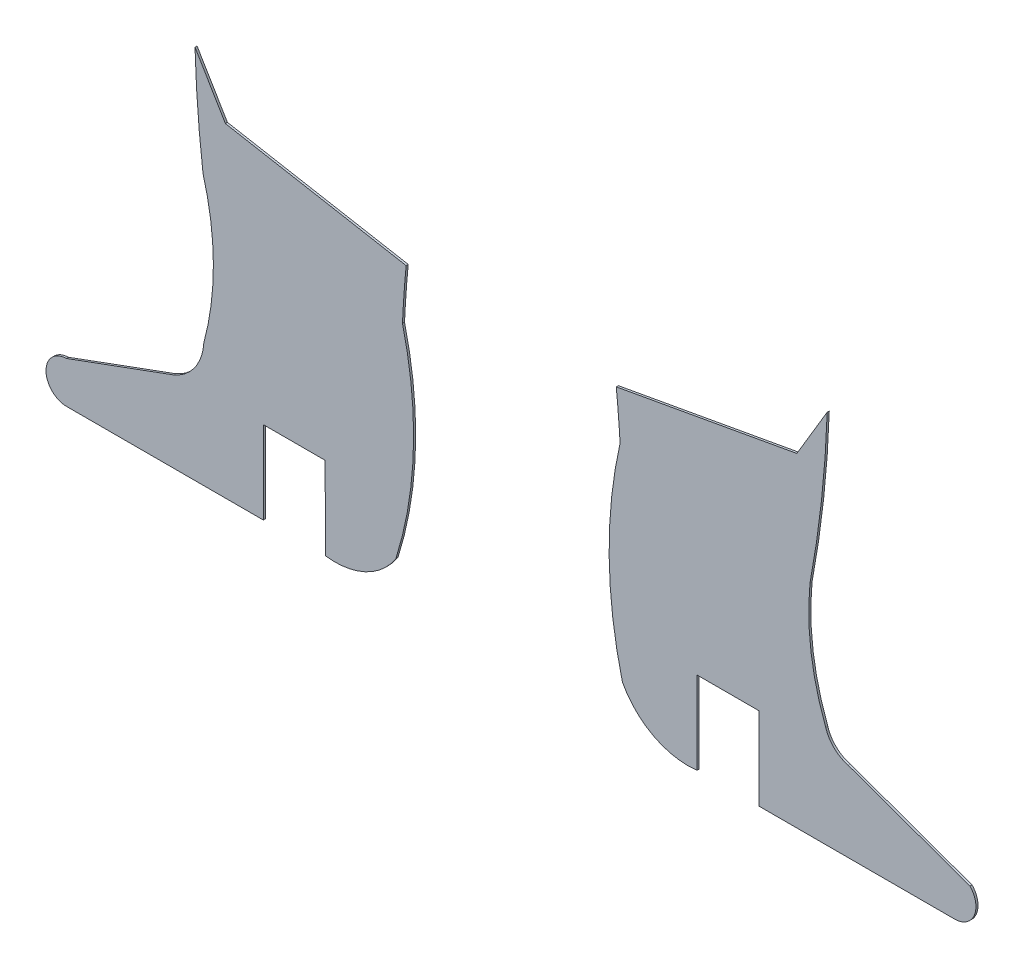
ISO-10303-21;
HEADER;
FILE_DESCRIPTION(('STEP AP214'),'2;1');
FILE_NAME('part.step','',(''),(''),'','','');
FILE_SCHEMA(('AUTOMOTIVE_DESIGN { 1 0 10303 214 1 1 1 1 }'));
ENDSEC;
DATA;
#1=APPLICATION_CONTEXT('core data for automotive mechanical design processes');
#2=APPLICATION_PROTOCOL_DEFINITION('international standard','automotive_design',2000,#1);
#3=PRODUCT_CONTEXT('',#1,'mechanical');
#4=PRODUCT('Part','Part','',(#3));
#5=PRODUCT_RELATED_PRODUCT_CATEGORY('part','',(#4));
#6=PRODUCT_DEFINITION_FORMATION('','',#4);
#7=PRODUCT_DEFINITION_CONTEXT('part definition',#1,'design');
#8=PRODUCT_DEFINITION('design','',#6,#7);
#9=PRODUCT_DEFINITION_SHAPE('','',#8);
#10=(LENGTH_UNIT() NAMED_UNIT(*) SI_UNIT(.MILLI.,.METRE.));
#11=(NAMED_UNIT(*) PLANE_ANGLE_UNIT() SI_UNIT($,.RADIAN.));
#12=(NAMED_UNIT(*) SI_UNIT($,.STERADIAN.) SOLID_ANGLE_UNIT());
#13=UNCERTAINTY_MEASURE_WITH_UNIT(LENGTH_MEASURE(1.E-05),#10,'distance_accuracy_value','');
#14=(GEOMETRIC_REPRESENTATION_CONTEXT(3) GLOBAL_UNCERTAINTY_ASSIGNED_CONTEXT((#13)) GLOBAL_UNIT_ASSIGNED_CONTEXT((#10,
#11,#12)) REPRESENTATION_CONTEXT('',''));
#15=CARTESIAN_POINT('',(0.,0.,0.));
#16=DIRECTION('',(0.,0.,1.));
#17=DIRECTION('',(1.,0.,0.));
#18=AXIS2_PLACEMENT_3D('',#15,#16,#17);
#19=CARTESIAN_POINT('',(26.9668124173611,-36.5903102609437,0.1));
#20=DIRECTION('',(0.,0.,-1.));
#21=DIRECTION('',(-1.,0.,0.));
#22=AXIS2_PLACEMENT_3D('',#19,#20,#21);
#23=CYLINDRICAL_SURFACE('',#22,3.50774536929648);
#24=CARTESIAN_POINT('',(26.9668124173611,-36.5903102609437,0.));
#25=DIRECTION('',(0.,0.,1.));
#26=DIRECTION('',(1.,0.,0.));
#27=AXIS2_PLACEMENT_3D('',#24,#25,#26);
#28=CIRCLE('',#27,3.50774536929648);
#29=CARTESIAN_POINT('',(26.5060514652921,-40.067662259357,0.));
#30=VERTEX_POINT('',#29);
#31=CARTESIAN_POINT('',(29.9209690938773,-38.4816684783142,0.));
#32=VERTEX_POINT('',#31);
#33=EDGE_CURVE('E175',#30,#32,#28,.T.);
#34=ORIENTED_EDGE('',*,*,#33,.T.);
#35=DIRECTION('',(0.,0.,-1.));
#36=VECTOR('',#35,1.);
#37=CARTESIAN_POINT('',(29.9209690938773,-38.4816684783142,0.1));
#38=LINE('',#37,#36);
#39=CARTESIAN_POINT('',(29.9209690938773,-38.4816684783142,0.1));
#40=VERTEX_POINT('',#39);
#41=EDGE_CURVE('E12',#40,#32,#38,.T.);
#42=ORIENTED_EDGE('',*,*,#41,.F.);
#43=CARTESIAN_POINT('',(26.9668124173611,-36.5903102609437,0.1));
#44=DIRECTION('',(0.,0.,1.));
#45=DIRECTION('',(1.,0.,0.));
#46=AXIS2_PLACEMENT_3D('',#43,#44,#45);
#47=CIRCLE('',#46,3.50774536929648);
#48=CARTESIAN_POINT('',(26.5060514652921,-40.067662259357,0.1));
#49=VERTEX_POINT('',#48);
#50=EDGE_CURVE('E201',#49,#40,#47,.T.);
#51=ORIENTED_EDGE('',*,*,#50,.F.);
#52=DIRECTION('',(0.,0.,-1.));
#53=VECTOR('',#52,1.);
#54=CARTESIAN_POINT('',(26.5060514652921,-40.067662259357,0.1));
#55=LINE('',#54,#53);
#56=EDGE_CURVE('E171',#49,#30,#55,.T.);
#57=ORIENTED_EDGE('',*,*,#56,.T.);
#58=EDGE_LOOP('',(#34,#42,#51,#57));
#59=FACE_BOUND('',#58,.T.);
#60=ADVANCED_FACE('F43',(#59),#23,.T.);
#61=CARTESIAN_POINT('',(12.2605166746826,-32.9008854136209,0.1));
#62=DIRECTION('',(0.,0.,-1.));
#63=DIRECTION('',(-1.,0.,0.));
#64=AXIS2_PLACEMENT_3D('',#61,#62,#63);
#65=CYLINDRICAL_SURFACE('',#64,18.5212504779188);
#66=CARTESIAN_POINT('',(12.2605166746826,-32.9008854136209,0.));
#67=DIRECTION('',(0.,0.,1.));
#68=DIRECTION('',(1.,0.,0.));
#69=AXIS2_PLACEMENT_3D('',#66,#67,#68);
#70=CIRCLE('',#69,18.5212504779188);
#71=CARTESIAN_POINT('',(30.2407803949786,-28.4571442179148,0.));
#72=VERTEX_POINT('',#71);
#73=EDGE_CURVE('E178',#32,#72,#70,.T.);
#74=ORIENTED_EDGE('',*,*,#73,.T.);
#75=DIRECTION('',(0.,0.,-1.));
#76=VECTOR('',#75,1.);
#77=CARTESIAN_POINT('',(30.2407803949786,-28.4571442179148,0.1));
#78=LINE('',#77,#76);
#79=CARTESIAN_POINT('',(30.2407803949786,-28.4571442179148,0.1));
#80=VERTEX_POINT('',#79);
#81=EDGE_CURVE('E51',#80,#72,#78,.T.);
#82=ORIENTED_EDGE('',*,*,#81,.F.);
#83=CARTESIAN_POINT('',(12.2605166746826,-32.9008854136209,0.1));
#84=DIRECTION('',(0.,0.,1.));
#85=DIRECTION('',(1.,0.,0.));
#86=AXIS2_PLACEMENT_3D('',#83,#84,#85);
#87=CIRCLE('',#86,18.5212504779188);
#88=EDGE_CURVE('E120',#40,#80,#87,.T.);
#89=ORIENTED_EDGE('',*,*,#88,.F.);
#90=ORIENTED_EDGE('',*,*,#41,.T.);
#91=EDGE_LOOP('',(#74,#82,#89,#90));
#92=FACE_BOUND('',#91,.T.);
#93=ADVANCED_FACE('F289',(#92),#65,.T.);
#94=CARTESIAN_POINT('',(83.6487375370313,-30.9690868706953,0.1));
#95=DIRECTION('',(0.,0.,-1.));
#96=DIRECTION('',(-1.,0.,0.));
#97=AXIS2_PLACEMENT_3D('',#94,#95,#96);
#98=CYLINDRICAL_SURFACE('',#97,53.4669967548037);
#99=CARTESIAN_POINT('',(83.6487375370313,-30.9690868706953,0.));
#100=DIRECTION('',(0.,0.,-1.));
#101=DIRECTION('',(1.,0.,0.));
#102=AXIS2_PLACEMENT_3D('',#99,#100,#101);
#103=CIRCLE('',#102,53.4669967548037);
#104=CARTESIAN_POINT('',(30.418644104399,-25.9414736067863,0.));
#105=VERTEX_POINT('',#104);
#106=EDGE_CURVE('E180',#72,#105,#103,.T.);
#107=ORIENTED_EDGE('',*,*,#106,.T.);
#108=DIRECTION('',(0.,0.,-1.));
#109=VECTOR('',#108,1.);
#110=CARTESIAN_POINT('',(30.418644104399,-25.9414736067863,0.1));
#111=LINE('',#110,#109);
#112=CARTESIAN_POINT('',(30.418644104399,-25.9414736067863,0.1));
#113=VERTEX_POINT('',#112);
#114=EDGE_CURVE('E226',#113,#105,#111,.T.);
#115=ORIENTED_EDGE('',*,*,#114,.F.);
#116=CARTESIAN_POINT('',(83.6487375370313,-30.9690868706953,0.1));
#117=DIRECTION('',(0.,0.,-1.));
#118=DIRECTION('',(1.,0.,0.));
#119=AXIS2_PLACEMENT_3D('',#116,#117,#118);
#120=CIRCLE('',#119,53.4669967548037);
#121=EDGE_CURVE('E234',#80,#113,#120,.T.);
#122=ORIENTED_EDGE('',*,*,#121,.F.);
#123=ORIENTED_EDGE('',*,*,#81,.T.);
#124=EDGE_LOOP('',(#107,#115,#122,#123));
#125=FACE_BOUND('',#124,.T.);
#126=ADVANCED_FACE('F232',(#125),#98,.F.);
#127=CARTESIAN_POINT('',(21.6663416401417,-24.3621518908138,0.1));
#128=DIRECTION('',(-0.177578526798536,-0.984106633866504,0.));
#129=DIRECTION('',(0.984106633866504,-0.177578526798536,0.));
#130=AXIS2_PLACEMENT_3D('',#127,#128,#129);
#131=PLANE('',#130);
#132=DIRECTION('',(-0.984106633866504,0.177578526798536,0.));
#133=VECTOR('',#132,1.);
#134=CARTESIAN_POINT('',(21.6663416401417,-24.3621518908138,0.));
#135=LINE('',#134,#133);
#136=CARTESIAN_POINT('',(21.6663416401417,-24.3621518908138,0.));
#137=VERTEX_POINT('',#136);
#138=EDGE_CURVE('E182',#105,#137,#135,.T.);
#139=ORIENTED_EDGE('',*,*,#138,.T.);
#140=DIRECTION('',(0.,0.,-1.));
#141=VECTOR('',#140,1.);
#142=CARTESIAN_POINT('',(21.6663416401417,-24.3621518908138,0.1));
#143=LINE('',#142,#141);
#144=CARTESIAN_POINT('',(21.6663416401417,-24.3621518908138,0.1));
#145=VERTEX_POINT('',#144);
#146=EDGE_CURVE('E223',#145,#137,#143,.T.);
#147=ORIENTED_EDGE('',*,*,#146,.F.);
#148=DIRECTION('',(-0.984106633866504,0.177578526798536,0.));
#149=VECTOR('',#148,1.);
#150=CARTESIAN_POINT('',(21.6663416401417,-24.3621518908138,0.1));
#151=LINE('',#150,#149);
#152=EDGE_CURVE('E252',#113,#145,#151,.T.);
#153=ORIENTED_EDGE('',*,*,#152,.F.);
#154=ORIENTED_EDGE('',*,*,#114,.T.);
#155=EDGE_LOOP('',(#139,#147,#153,#154));
#156=FACE_BOUND('',#155,.T.);
#157=ADVANCED_FACE('F243',(#156),#131,.F.);
#158=CARTESIAN_POINT('',(20.1968502259479,-21.8973035343896,0.1));
#159=DIRECTION('',(-0.858937381336888,-0.512080633242588,0.));
#160=DIRECTION('',(0.512080633242588,-0.858937381336888,0.));
#161=AXIS2_PLACEMENT_3D('',#158,#159,#160);
#162=PLANE('',#161);
#163=DIRECTION('',(-0.512080633242588,0.858937381336888,0.));
#164=VECTOR('',#163,1.);
#165=CARTESIAN_POINT('',(20.1968502259479,-21.8973035343896,0.));
#166=LINE('',#165,#164);
#167=CARTESIAN_POINT('',(20.1968502259479,-21.8973035343896,0.));
#168=VERTEX_POINT('',#167);
#169=EDGE_CURVE('E184',#137,#168,#166,.T.);
#170=ORIENTED_EDGE('',*,*,#169,.T.);
#171=DIRECTION('',(0.,0.,-1.));
#172=VECTOR('',#171,1.);
#173=CARTESIAN_POINT('',(20.1968502259479,-21.8973035343896,0.1));
#174=LINE('',#173,#172);
#175=CARTESIAN_POINT('',(20.1968502259479,-21.8973035343896,0.1));
#176=VERTEX_POINT('',#175);
#177=EDGE_CURVE('E220',#176,#168,#174,.T.);
#178=ORIENTED_EDGE('',*,*,#177,.F.);
#179=DIRECTION('',(-0.512080633242588,0.858937381336888,0.));
#180=VECTOR('',#179,1.);
#181=CARTESIAN_POINT('',(20.1968502259479,-21.8973035343896,0.1));
#182=LINE('',#181,#180);
#183=EDGE_CURVE('E249',#145,#176,#182,.T.);
#184=ORIENTED_EDGE('',*,*,#183,.F.);
#185=ORIENTED_EDGE('',*,*,#146,.T.);
#186=EDGE_LOOP('',(#170,#178,#184,#185));
#187=FACE_BOUND('',#186,.T.);
#188=ADVANCED_FACE('F247',(#187),#162,.F.);
#189=CARTESIAN_POINT('',(74.3235203997203,-20.34952385995,0.1));
#190=DIRECTION('',(0.,0.,-1.));
#191=DIRECTION('',(-1.,0.,0.));
#192=AXIS2_PLACEMENT_3D('',#189,#190,#191);
#193=CYLINDRICAL_SURFACE('',#192,54.148795425392);
#194=CARTESIAN_POINT('',(74.3235203997203,-20.34952385995,0.));
#195=DIRECTION('',(0.,0.,1.));
#196=DIRECTION('',(1.,0.,0.));
#197=AXIS2_PLACEMENT_3D('',#194,#195,#196);
#198=CIRCLE('',#197,54.148795425392);
#199=CARTESIAN_POINT('',(20.5846174061034,-26.9995126617135,0.));
#200=VERTEX_POINT('',#199);
#201=EDGE_CURVE('E186',#168,#200,#198,.T.);
#202=ORIENTED_EDGE('',*,*,#201,.T.);
#203=DIRECTION('',(0.,0.,-1.));
#204=VECTOR('',#203,1.);
#205=CARTESIAN_POINT('',(20.5846174061034,-26.9995126617135,0.1));
#206=LINE('',#205,#204);
#207=CARTESIAN_POINT('',(20.5846174061034,-26.9995126617135,0.1));
#208=VERTEX_POINT('',#207);
#209=EDGE_CURVE('E217',#208,#200,#206,.T.);
#210=ORIENTED_EDGE('',*,*,#209,.F.);
#211=CARTESIAN_POINT('',(74.3235203997203,-20.34952385995,0.1));
#212=DIRECTION('',(0.,0.,1.));
#213=DIRECTION('',(1.,0.,0.));
#214=AXIS2_PLACEMENT_3D('',#211,#212,#213);
#215=CIRCLE('',#214,54.148795425392);
#216=EDGE_CURVE('E251',#176,#208,#215,.T.);
#217=ORIENTED_EDGE('',*,*,#216,.F.);
#218=ORIENTED_EDGE('',*,*,#177,.T.);
#219=EDGE_LOOP('',(#202,#210,#217,#218));
#220=FACE_BOUND('',#219,.T.);
#221=ADVANCED_FACE('F302',(#220),#193,.T.);
#222=CARTESIAN_POINT('',(7.84179174265444,-30.6110247408629,0.1));
#223=DIRECTION('',(0.,0.,-1.));
#224=DIRECTION('',(-1.,0.,0.));
#225=AXIS2_PLACEMENT_3D('',#222,#223,#224);
#226=CYLINDRICAL_SURFACE('',#225,13.2447206609613);
#227=CARTESIAN_POINT('',(7.84179174265444,-30.6110247408629,0.));
#228=DIRECTION('',(0.,0.,-1.));
#229=DIRECTION('',(1.,0.,0.));
#230=AXIS2_PLACEMENT_3D('',#227,#228,#229);
#231=CIRCLE('',#230,13.2447206609613);
#232=CARTESIAN_POINT('',(20.6215773255446,-34.0894878845871,0.));
#233=VERTEX_POINT('',#232);
#234=EDGE_CURVE('E188',#200,#233,#231,.T.);
#235=ORIENTED_EDGE('',*,*,#234,.T.);
#236=DIRECTION('',(0.,0.,-1.));
#237=VECTOR('',#236,1.);
#238=CARTESIAN_POINT('',(20.6215773255446,-34.0894878845871,0.1));
#239=LINE('',#238,#237);
#240=CARTESIAN_POINT('',(20.6215773255446,-34.0894878845871,0.1));
#241=VERTEX_POINT('',#240);
#242=EDGE_CURVE('E214',#241,#233,#239,.T.);
#243=ORIENTED_EDGE('',*,*,#242,.F.);
#244=CARTESIAN_POINT('',(7.84179174265444,-30.6110247408629,0.1));
#245=DIRECTION('',(0.,0.,-1.));
#246=DIRECTION('',(1.,0.,0.));
#247=AXIS2_PLACEMENT_3D('',#244,#245,#246);
#248=CIRCLE('',#247,13.2447206609613);
#249=EDGE_CURVE('E254',#208,#241,#248,.T.);
#250=ORIENTED_EDGE('',*,*,#249,.F.);
#251=ORIENTED_EDGE('',*,*,#209,.T.);
#252=EDGE_LOOP('',(#235,#243,#250,#251));
#253=FACE_BOUND('',#252,.T.);
#254=ADVANCED_FACE('F305',(#253),#226,.F.);
#255=CARTESIAN_POINT('',(18.2302408129095,-33.9493431378482,0.1));
#256=DIRECTION('',(0.,0.,-1.));
#257=DIRECTION('',(-1.,0.,0.));
#258=AXIS2_PLACEMENT_3D('',#255,#256,#257);
#259=CYLINDRICAL_SURFACE('',#258,2.39543959779839);
#260=CARTESIAN_POINT('',(18.2302408129095,-33.9493431378482,0.));
#261=DIRECTION('',(0.,0.,-1.));
#262=DIRECTION('',(1.,0.,0.));
#263=AXIS2_PLACEMENT_3D('',#260,#261,#262);
#264=CIRCLE('',#263,2.39543959779839);
#265=CARTESIAN_POINT('',(19.1662659452414,-36.1543347066175,0.));
#266=VERTEX_POINT('',#265);
#267=EDGE_CURVE('E190',#233,#266,#264,.T.);
#268=ORIENTED_EDGE('',*,*,#267,.T.);
#269=DIRECTION('',(0.,0.,-1.));
#270=VECTOR('',#269,1.);
#271=CARTESIAN_POINT('',(19.1662659452414,-36.1543347066175,0.1));
#272=LINE('',#271,#270);
#273=CARTESIAN_POINT('',(19.1662659452414,-36.1543347066175,0.1));
#274=VERTEX_POINT('',#273);
#275=EDGE_CURVE('E211',#274,#266,#272,.T.);
#276=ORIENTED_EDGE('',*,*,#275,.F.);
#277=CARTESIAN_POINT('',(18.2302408129095,-33.9493431378482,0.1));
#278=DIRECTION('',(0.,0.,-1.));
#279=DIRECTION('',(1.,0.,0.));
#280=AXIS2_PLACEMENT_3D('',#277,#278,#279);
#281=CIRCLE('',#280,2.39543959779839);
#282=EDGE_CURVE('E260',#241,#274,#281,.T.);
#283=ORIENTED_EDGE('',*,*,#282,.F.);
#284=ORIENTED_EDGE('',*,*,#242,.T.);
#285=EDGE_LOOP('',(#268,#276,#283,#284));
#286=FACE_BOUND('',#285,.T.);
#287=ADVANCED_FACE('F309',(#286),#259,.F.);
#288=CARTESIAN_POINT('',(19.1662659452414,-36.1543347066175,0.1));
#289=DIRECTION('',(0.344465571501462,-0.938798950814375,0.));
#290=DIRECTION('',(0.938798950814375,0.344465571501462,0.));
#291=AXIS2_PLACEMENT_3D('',#288,#289,#290);
#292=PLANE('',#291);
#293=DIRECTION('',(-0.938798950814375,-0.344465571501462,0.));
#294=VECTOR('',#293,1.);
#295=CARTESIAN_POINT('',(19.1662659452414,-36.1543347066175,0.));
#296=LINE('',#295,#294);
#297=CARTESIAN_POINT('',(13.9640958484851,-38.0631230514196,0.));
#298=VERTEX_POINT('',#297);
#299=EDGE_CURVE('E192',#266,#298,#296,.T.);
#300=ORIENTED_EDGE('',*,*,#299,.T.);
#301=DIRECTION('',(0.,0.,-1.));
#302=VECTOR('',#301,1.);
#303=CARTESIAN_POINT('',(13.9640958484851,-38.0631230514196,0.1));
#304=LINE('',#303,#302);
#305=CARTESIAN_POINT('',(13.9640958484851,-38.0631230514196,0.1));
#306=VERTEX_POINT('',#305);
#307=EDGE_CURVE('E208',#306,#298,#304,.T.);
#308=ORIENTED_EDGE('',*,*,#307,.F.);
#309=DIRECTION('',(-0.938798950814375,-0.344465571501462,0.));
#310=VECTOR('',#309,1.);
#311=CARTESIAN_POINT('',(19.1662659452414,-36.1543347066175,0.1));
#312=LINE('',#311,#310);
#313=EDGE_CURVE('E262',#274,#306,#312,.T.);
#314=ORIENTED_EDGE('',*,*,#313,.F.);
#315=ORIENTED_EDGE('',*,*,#275,.T.);
#316=EDGE_LOOP('',(#300,#308,#314,#315));
#317=FACE_BOUND('',#316,.T.);
#318=ADVANCED_FACE('F313',(#317),#292,.F.);
#319=CARTESIAN_POINT('',(13.9857025211604,-39.0667782790297,0.1));
#320=DIRECTION('',(0.,0.,-1.));
#321=DIRECTION('',(-1.,0.,0.));
#322=AXIS2_PLACEMENT_3D('',#319,#320,#321);
#323=CYLINDRICAL_SURFACE('',#322,1.00388777471043);
#324=CARTESIAN_POINT('',(13.9857025211604,-39.0667782790297,0.));
#325=DIRECTION('',(0.,0.,1.));
#326=DIRECTION('',(1.,0.,0.));
#327=AXIS2_PLACEMENT_3D('',#324,#325,#326);
#328=CIRCLE('',#327,1.00388777471043);
#329=CARTESIAN_POINT('',(14.0073091938358,-40.0704335066397,0.));
#330=VERTEX_POINT('',#329);
#331=EDGE_CURVE('E194',#298,#330,#328,.T.);
#332=ORIENTED_EDGE('',*,*,#331,.T.);
#333=DIRECTION('',(0.,0.,-1.));
#334=VECTOR('',#333,1.);
#335=CARTESIAN_POINT('',(14.0073091938358,-40.0704335066397,0.1));
#336=LINE('',#335,#334);
#337=CARTESIAN_POINT('',(14.0073091938358,-40.0704335066397,0.1));
#338=VERTEX_POINT('',#337);
#339=EDGE_CURVE('E205',#338,#330,#336,.T.);
#340=ORIENTED_EDGE('',*,*,#339,.F.);
#341=CARTESIAN_POINT('',(13.9857025211604,-39.0667782790297,0.1));
#342=DIRECTION('',(0.,0.,1.));
#343=DIRECTION('',(1.,0.,0.));
#344=AXIS2_PLACEMENT_3D('',#341,#342,#343);
#345=CIRCLE('',#344,1.00388777471043);
#346=EDGE_CURVE('E264',#306,#338,#345,.T.);
#347=ORIENTED_EDGE('',*,*,#346,.F.);
#348=ORIENTED_EDGE('',*,*,#307,.T.);
#349=EDGE_LOOP('',(#332,#340,#347,#348));
#350=FACE_BOUND('',#349,.T.);
#351=ADVANCED_FACE('F270',(#350),#323,.T.);
#352=CARTESIAN_POINT('',(14.0073091938358,-40.0704335066397,0.1));
#353=DIRECTION('',(-0.000146344526064041,0.99999998929164,0.));
#354=DIRECTION('',(-0.99999998929164,-0.000146344526064041,0.));
#355=AXIS2_PLACEMENT_3D('',#352,#353,#354);
#356=PLANE('',#355);
#357=DIRECTION('',(0.99999998929164,0.000146344526064041,0.));
#358=VECTOR('',#357,1.);
#359=CARTESIAN_POINT('',(14.0073091938358,-40.0704335066397,0.));
#360=LINE('',#359,#358);
#361=CARTESIAN_POINT('',(23.506051635292,-40.069043417664,0.));
#362=VERTEX_POINT('',#361);
#363=EDGE_CURVE('E196',#330,#362,#360,.T.);
#364=ORIENTED_EDGE('',*,*,#363,.T.);
#365=DIRECTION('',(0.,0.,-1.));
#366=VECTOR('',#365,1.);
#367=CARTESIAN_POINT('',(23.506051635292,-40.069043417664,0.1));
#368=LINE('',#367,#366);
#369=CARTESIAN_POINT('',(23.506051635292,-40.069043417664,0.1));
#370=VERTEX_POINT('',#369);
#371=EDGE_CURVE('E166',#370,#362,#368,.T.);
#372=ORIENTED_EDGE('',*,*,#371,.F.);
#373=DIRECTION('',(0.99999998929164,0.000146344526064041,0.));
#374=VECTOR('',#373,1.);
#375=CARTESIAN_POINT('',(14.0073091938358,-40.0704335066397,0.1));
#376=LINE('',#375,#374);
#377=EDGE_CURVE('E157',#338,#370,#376,.T.);
#378=ORIENTED_EDGE('',*,*,#377,.F.);
#379=ORIENTED_EDGE('',*,*,#339,.T.);
#380=EDGE_LOOP('',(#364,#372,#378,#379));
#381=FACE_BOUND('',#380,.T.);
#382=ADVANCED_FACE('F274',(#381),#356,.F.);
#383=CARTESIAN_POINT('',(23.506051635292,-40.069043417664,0.1));
#384=DIRECTION('',(-0.99999998929164,-0.000146344526057336,0.));
#385=DIRECTION('',(0.000146344526057336,-0.99999998929164,0.));
#386=AXIS2_PLACEMENT_3D('',#383,#384,#385);
#387=PLANE('',#386);
#388=DIRECTION('',(-0.000146344526057336,0.99999998929164,0.));
#389=VECTOR('',#388,1.);
#390=CARTESIAN_POINT('',(23.506051635292,-40.069043417664,0.));
#391=LINE('',#390,#389);
#392=CARTESIAN_POINT('',(23.5054662571878,-36.0690434604975,0.));
#393=VERTEX_POINT('',#392);
#394=EDGE_CURVE('E165',#362,#393,#391,.T.);
#395=ORIENTED_EDGE('',*,*,#394,.T.);
#396=DIRECTION('',(0.,0.,-1.));
#397=VECTOR('',#396,1.);
#398=CARTESIAN_POINT('',(23.5054662571878,-36.0690434604975,0.1));
#399=LINE('',#398,#397);
#400=CARTESIAN_POINT('',(23.5054662571878,-36.0690434604975,0.1));
#401=VERTEX_POINT('',#400);
#402=EDGE_CURVE('E162',#401,#393,#399,.T.);
#403=ORIENTED_EDGE('',*,*,#402,.F.);
#404=DIRECTION('',(-0.000146344526057336,0.99999998929164,0.));
#405=VECTOR('',#404,1.);
#406=CARTESIAN_POINT('',(23.506051635292,-40.069043417664,0.1));
#407=LINE('',#406,#405);
#408=EDGE_CURVE('E151',#370,#401,#407,.T.);
#409=ORIENTED_EDGE('',*,*,#408,.F.);
#410=ORIENTED_EDGE('',*,*,#371,.T.);
#411=EDGE_LOOP('',(#395,#403,#409,#410));
#412=FACE_BOUND('',#411,.T.);
#413=ADVANCED_FACE('F163',(#412),#387,.F.);
#414=CARTESIAN_POINT('',(23.5054662571878,-36.0690434604975,0.1));
#415=DIRECTION('',(-0.000146344526062892,0.99999998929164,0.));
#416=DIRECTION('',(-0.99999998929164,-0.000146344526062892,0.));
#417=AXIS2_PLACEMENT_3D('',#414,#415,#416);
#418=PLANE('',#417);
#419=DIRECTION('',(0.99999998929164,0.000146344526062892,0.));
#420=VECTOR('',#419,1.);
#421=CARTESIAN_POINT('',(23.5054662571878,-36.0690434604975,0.));
#422=LINE('',#421,#420);
#423=CARTESIAN_POINT('',(26.5012692553908,-36.0686050411228,0.));
#424=VERTEX_POINT('',#423);
#425=EDGE_CURVE('E106',#393,#424,#422,.T.);
#426=ORIENTED_EDGE('',*,*,#425,.T.);
#427=DIRECTION('',(0.,0.,-1.));
#428=VECTOR('',#427,1.);
#429=CARTESIAN_POINT('',(26.5012692553908,-36.0686050411228,0.1));
#430=LINE('',#429,#428);
#431=CARTESIAN_POINT('',(26.5012692553908,-36.0686050411228,0.1));
#432=VERTEX_POINT('',#431);
#433=EDGE_CURVE('E167',#432,#424,#430,.T.);
#434=ORIENTED_EDGE('',*,*,#433,.F.);
#435=DIRECTION('',(0.99999998929164,0.000146344526062892,0.));
#436=VECTOR('',#435,1.);
#437=CARTESIAN_POINT('',(23.5054662571878,-36.0690434604975,0.1));
#438=LINE('',#437,#436);
#439=EDGE_CURVE('E155',#401,#432,#438,.T.);
#440=ORIENTED_EDGE('',*,*,#439,.F.);
#441=ORIENTED_EDGE('',*,*,#402,.T.);
#442=EDGE_LOOP('',(#426,#434,#440,#441));
#443=FACE_BOUND('',#442,.T.);
#444=ADVANCED_FACE('F169',(#443),#418,.F.);
#445=CARTESIAN_POINT('',(26.5012692553908,-36.0686050411228,0.1));
#446=DIRECTION('',(0.999999284990897,0.00119583347300877,0.));
#447=DIRECTION('',(-0.00119583347300877,0.999999284990897,0.));
#448=AXIS2_PLACEMENT_3D('',#445,#446,#447);
#449=PLANE('',#448);
#450=DIRECTION('',(0.00119583347300877,-0.999999284990897,0.));
#451=VECTOR('',#450,1.);
#452=CARTESIAN_POINT('',(26.5012692553908,-36.0686050411228,0.));
#453=LINE('',#452,#451);
#454=EDGE_CURVE('E112',#424,#30,#453,.T.);
#455=ORIENTED_EDGE('',*,*,#454,.T.);
#456=ORIENTED_EDGE('',*,*,#56,.F.);
#457=DIRECTION('',(0.00119583347300877,-0.999999284990897,0.));
#458=VECTOR('',#457,1.);
#459=CARTESIAN_POINT('',(26.5012692553908,-36.0686050411228,0.1));
#460=LINE('',#459,#458);
#461=EDGE_CURVE('E59',#432,#49,#460,.T.);
#462=ORIENTED_EDGE('',*,*,#461,.F.);
#463=ORIENTED_EDGE('',*,*,#433,.T.);
#464=EDGE_LOOP('',(#455,#456,#462,#463));
#465=FACE_BOUND('',#464,.T.);
#466=ADVANCED_FACE('F278',(#465),#449,.F.);
#467=CARTESIAN_POINT('',(26.9668124173611,-36.5903102609437,0.1));
#468=DIRECTION('',(0.,0.,1.));
#469=DIRECTION('',(1.,0.,0.));
#470=AXIS2_PLACEMENT_3D('',#467,#468,#469);
#471=PLANE('',#470);
#472=ORIENTED_EDGE('',*,*,#50,.T.);
#473=ORIENTED_EDGE('',*,*,#88,.T.);
#474=ORIENTED_EDGE('',*,*,#121,.T.);
#475=ORIENTED_EDGE('',*,*,#152,.T.);
#476=ORIENTED_EDGE('',*,*,#183,.T.);
#477=ORIENTED_EDGE('',*,*,#216,.T.);
#478=ORIENTED_EDGE('',*,*,#249,.T.);
#479=ORIENTED_EDGE('',*,*,#282,.T.);
#480=ORIENTED_EDGE('',*,*,#313,.T.);
#481=ORIENTED_EDGE('',*,*,#346,.T.);
#482=ORIENTED_EDGE('',*,*,#377,.T.);
#483=ORIENTED_EDGE('',*,*,#408,.T.);
#484=ORIENTED_EDGE('',*,*,#439,.T.);
#485=ORIENTED_EDGE('',*,*,#461,.T.);
#486=EDGE_LOOP('',(#472,#473,#474,#475,#476,#477,#478,#479,#480,#481,#482,#483,#484,#485));
#487=FACE_BOUND('',#486,.T.);
#488=ADVANCED_FACE('F153',(#487),#471,.T.);
#489=CARTESIAN_POINT('',(26.9668124173611,-36.5903102609437,0.));
#490=DIRECTION('',(0.,0.,1.));
#491=DIRECTION('',(1.,0.,0.));
#492=AXIS2_PLACEMENT_3D('',#489,#490,#491);
#493=PLANE('',#492);
#494=ORIENTED_EDGE('',*,*,#33,.F.);
#495=ORIENTED_EDGE('',*,*,#454,.F.);
#496=ORIENTED_EDGE('',*,*,#425,.F.);
#497=ORIENTED_EDGE('',*,*,#394,.F.);
#498=ORIENTED_EDGE('',*,*,#363,.F.);
#499=ORIENTED_EDGE('',*,*,#331,.F.);
#500=ORIENTED_EDGE('',*,*,#299,.F.);
#501=ORIENTED_EDGE('',*,*,#267,.F.);
#502=ORIENTED_EDGE('',*,*,#234,.F.);
#503=ORIENTED_EDGE('',*,*,#201,.F.);
#504=ORIENTED_EDGE('',*,*,#169,.F.);
#505=ORIENTED_EDGE('',*,*,#138,.F.);
#506=ORIENTED_EDGE('',*,*,#106,.F.);
#507=ORIENTED_EDGE('',*,*,#73,.F.);
#508=EDGE_LOOP('',(#494,#495,#496,#497,#498,#499,#500,#501,#502,#503,#504,#505,#506,#507));
#509=FACE_BOUND('',#508,.T.);
#510=ADVANCED_FACE('F238',(#509),#493,.F.);
#511=CLOSED_SHELL('',(#60,#93,#126,#157,#188,#221,#254,#287,#318,#351,#382,#413,#444,#466,#488,#510));
#512=MANIFOLD_SOLID_BREP('B2',#511);
#513=CARTESIAN_POINT('',(-17.4188228749307,-31.8121300697619,0.1));
#514=DIRECTION('',(0.,0.,-1.));
#515=DIRECTION('',(-1.,0.,0.));
#516=AXIS2_PLACEMENT_3D('',#513,#514,#515);
#517=CYLINDRICAL_SURFACE('',#516,58.3094921618427);
#518=CARTESIAN_POINT('',(-17.4188228749307,-31.8121300697619,0.));
#519=DIRECTION('',(0.,0.,-1.));
#520=DIRECTION('',(1.,0.,0.));
#521=AXIS2_PLACEMENT_3D('',#518,#519,#520);
#522=CIRCLE('',#521,58.3094921618427);
#523=CARTESIAN_POINT('',(40.5942494021403,-25.9401354216595,0.));
#524=VERTEX_POINT('',#523);
#525=CARTESIAN_POINT('',(40.7792329891328,-28.2089134768625,0.));
#526=VERTEX_POINT('',#525);
#527=EDGE_CURVE('E559',#524,#526,#522,.T.);
#528=ORIENTED_EDGE('',*,*,#527,.T.);
#529=DIRECTION('',(0.,0.,-1.));
#530=VECTOR('',#529,1.);
#531=CARTESIAN_POINT('',(40.7792329891328,-28.2089134768625,0.1));
#532=LINE('',#531,#530);
#533=CARTESIAN_POINT('',(40.7792329891328,-28.2089134768625,0.1));
#534=VERTEX_POINT('',#533);
#535=EDGE_CURVE('E41',#534,#526,#532,.T.);
#536=ORIENTED_EDGE('',*,*,#535,.F.);
#537=CARTESIAN_POINT('',(-17.4188228749307,-31.8121300697619,0.1));
#538=DIRECTION('',(0.,0.,-1.));
#539=DIRECTION('',(1.,0.,0.));
#540=AXIS2_PLACEMENT_3D('',#537,#538,#539);
#541=CIRCLE('',#540,58.3094921618427);
#542=CARTESIAN_POINT('',(40.5942494021403,-25.9401354216595,0.1));
#543=VERTEX_POINT('',#542);
#544=EDGE_CURVE('E585',#543,#534,#541,.T.);
#545=ORIENTED_EDGE('',*,*,#544,.F.);
#546=DIRECTION('',(0.,0.,-1.));
#547=VECTOR('',#546,1.);
#548=CARTESIAN_POINT('',(40.5942494021403,-25.9401354216595,0.1));
#549=LINE('',#548,#547);
#550=EDGE_CURVE('E555',#543,#524,#549,.T.);
#551=ORIENTED_EDGE('',*,*,#550,.T.);
#552=EDGE_LOOP('',(#528,#536,#545,#551));
#553=FACE_BOUND('',#552,.T.);
#554=ADVANCED_FACE('F427',(#553),#517,.F.);
#555=CARTESIAN_POINT('',(61.6733365692399,-32.9562243356833,0.1));
#556=DIRECTION('',(0.,0.,-1.));
#557=DIRECTION('',(-1.,0.,0.));
#558=AXIS2_PLACEMENT_3D('',#555,#556,#557);
#559=CYLINDRICAL_SURFACE('',#558,21.426631205267);
#560=CARTESIAN_POINT('',(61.6733365692399,-32.9562243356833,0.));
#561=DIRECTION('',(0.,0.,1.));
#562=DIRECTION('',(1.,0.,0.));
#563=AXIS2_PLACEMENT_3D('',#560,#561,#562);
#564=CIRCLE('',#563,21.426631205267);
#565=CARTESIAN_POINT('',(40.8903170846337,-38.16838568286,0.));
#566=VERTEX_POINT('',#565);
#567=EDGE_CURVE('E562',#526,#566,#564,.T.);
#568=ORIENTED_EDGE('',*,*,#567,.T.);
#569=DIRECTION('',(0.,0.,-1.));
#570=VECTOR('',#569,1.);
#571=CARTESIAN_POINT('',(40.8903170846337,-38.16838568286,0.1));
#572=LINE('',#571,#570);
#573=CARTESIAN_POINT('',(40.8903170846337,-38.16838568286,0.1));
#574=VERTEX_POINT('',#573);
#575=EDGE_CURVE('E435',#574,#566,#572,.T.);
#576=ORIENTED_EDGE('',*,*,#575,.F.);
#577=CARTESIAN_POINT('',(61.6733365692399,-32.9562243356833,0.1));
#578=DIRECTION('',(0.,0.,1.));
#579=DIRECTION('',(1.,0.,0.));
#580=AXIS2_PLACEMENT_3D('',#577,#578,#579);
#581=CIRCLE('',#580,21.426631205267);
#582=EDGE_CURVE('E504',#534,#574,#581,.T.);
#583=ORIENTED_EDGE('',*,*,#582,.F.);
#584=ORIENTED_EDGE('',*,*,#535,.T.);
#585=EDGE_LOOP('',(#568,#576,#583,#584));
#586=FACE_BOUND('',#585,.T.);
#587=ADVANCED_FACE('F673',(#586),#559,.T.);
#588=CARTESIAN_POINT('',(44.075289976384,-36.4945853699133,0.1));
#589=DIRECTION('',(0.,0.,-1.));
#590=DIRECTION('',(-1.,0.,0.));
#591=AXIS2_PLACEMENT_3D('',#588,#589,#590);
#592=CYLINDRICAL_SURFACE('',#591,3.59800775552313);
#593=CARTESIAN_POINT('',(44.075289976384,-36.4945853699133,0.));
#594=DIRECTION('',(0.,0.,1.));
#595=DIRECTION('',(1.,0.,0.));
#596=AXIS2_PLACEMENT_3D('',#593,#594,#595);
#597=CIRCLE('',#596,3.59800775552313);
#598=CARTESIAN_POINT('',(44.5012692553908,-40.0672876332794,0.));
#599=VERTEX_POINT('',#598);
#600=EDGE_CURVE('E564',#566,#599,#597,.T.);
#601=ORIENTED_EDGE('',*,*,#600,.T.);
#602=DIRECTION('',(0.,0.,-1.));
#603=VECTOR('',#602,1.);
#604=CARTESIAN_POINT('',(44.5012692553908,-40.0672876332794,0.1));
#605=LINE('',#604,#603);
#606=CARTESIAN_POINT('',(44.5012692553908,-40.0672876332794,0.1));
#607=VERTEX_POINT('',#606);
#608=EDGE_CURVE('E610',#607,#599,#605,.T.);
#609=ORIENTED_EDGE('',*,*,#608,.F.);
#610=CARTESIAN_POINT('',(44.075289976384,-36.4945853699133,0.1));
#611=DIRECTION('',(0.,0.,1.));
#612=DIRECTION('',(1.,0.,0.));
#613=AXIS2_PLACEMENT_3D('',#610,#611,#612);
#614=CIRCLE('',#613,3.59800775552313);
#615=EDGE_CURVE('E618',#574,#607,#614,.T.);
#616=ORIENTED_EDGE('',*,*,#615,.F.);
#617=ORIENTED_EDGE('',*,*,#575,.T.);
#618=EDGE_LOOP('',(#601,#609,#616,#617));
#619=FACE_BOUND('',#618,.T.);
#620=ADVANCED_FACE('F616',(#619),#592,.T.);
#621=CARTESIAN_POINT('',(44.5012692553908,-40.0672876332794,0.1));
#622=DIRECTION('',(-1.,0.,0.));
#623=DIRECTION('',(0.,-1.,0.));
#624=AXIS2_PLACEMENT_3D('',#621,#622,#623);
#625=PLANE('',#624);
#626=DIRECTION('',(0.,1.,0.));
#627=VECTOR('',#626,1.);
#628=CARTESIAN_POINT('',(44.5012692553908,-40.0672876332794,0.));
#629=LINE('',#628,#627);
#630=CARTESIAN_POINT('',(44.5012692553908,-36.0672876332794,0.));
#631=VERTEX_POINT('',#630);
#632=EDGE_CURVE('E566',#599,#631,#629,.T.);
#633=ORIENTED_EDGE('',*,*,#632,.T.);
#634=DIRECTION('',(0.,0.,-1.));
#635=VECTOR('',#634,1.);
#636=CARTESIAN_POINT('',(44.5012692553908,-36.0672876332794,0.1));
#637=LINE('',#636,#635);
#638=CARTESIAN_POINT('',(44.5012692553908,-36.0672876332794,0.1));
#639=VERTEX_POINT('',#638);
#640=EDGE_CURVE('E607',#639,#631,#637,.T.);
#641=ORIENTED_EDGE('',*,*,#640,.F.);
#642=DIRECTION('',(0.,1.,0.));
#643=VECTOR('',#642,1.);
#644=CARTESIAN_POINT('',(44.5012692553908,-40.0672876332794,0.1));
#645=LINE('',#644,#643);
#646=EDGE_CURVE('E636',#607,#639,#645,.T.);
#647=ORIENTED_EDGE('',*,*,#646,.F.);
#648=ORIENTED_EDGE('',*,*,#608,.T.);
#649=EDGE_LOOP('',(#633,#641,#647,#648));
#650=FACE_BOUND('',#649,.T.);
#651=ADVANCED_FACE('F627',(#650),#625,.F.);
#652=CARTESIAN_POINT('',(44.5012692553908,-36.0672876332794,0.1));
#653=DIRECTION('',(0.,1.,0.));
#654=DIRECTION('',(0.,0.,1.));
#655=AXIS2_PLACEMENT_3D('',#652,#653,#654);
#656=PLANE('',#655);
#657=DIRECTION('',(1.,0.,0.));
#658=VECTOR('',#657,1.);
#659=CARTESIAN_POINT('',(44.5012692553908,-36.0672876332794,0.));
#660=LINE('',#659,#658);
#661=CARTESIAN_POINT('',(47.5012692553908,-36.0672876332794,0.));
#662=VERTEX_POINT('',#661);
#663=EDGE_CURVE('E568',#631,#662,#660,.T.);
#664=ORIENTED_EDGE('',*,*,#663,.T.);
#665=DIRECTION('',(0.,0.,-1.));
#666=VECTOR('',#665,1.);
#667=CARTESIAN_POINT('',(47.5012692553908,-36.0672876332794,0.1));
#668=LINE('',#667,#666);
#669=CARTESIAN_POINT('',(47.5012692553908,-36.0672876332794,0.1));
#670=VERTEX_POINT('',#669);
#671=EDGE_CURVE('E604',#670,#662,#668,.T.);
#672=ORIENTED_EDGE('',*,*,#671,.F.);
#673=DIRECTION('',(1.,0.,0.));
#674=VECTOR('',#673,1.);
#675=CARTESIAN_POINT('',(44.5012692553908,-36.0672876332794,0.1));
#676=LINE('',#675,#674);
#677=EDGE_CURVE('E633',#639,#670,#676,.T.);
#678=ORIENTED_EDGE('',*,*,#677,.F.);
#679=ORIENTED_EDGE('',*,*,#640,.T.);
#680=EDGE_LOOP('',(#664,#672,#678,#679));
#681=FACE_BOUND('',#680,.T.);
#682=ADVANCED_FACE('F631',(#681),#656,.F.);
#683=CARTESIAN_POINT('',(47.5012692553908,-36.0672876332794,0.1));
#684=DIRECTION('',(1.,0.,0.));
#685=DIRECTION('',(0.,0.,-1.));
#686=AXIS2_PLACEMENT_3D('',#683,#684,#685);
#687=PLANE('',#686);
#688=DIRECTION('',(0.,-1.,0.));
#689=VECTOR('',#688,1.);
#690=CARTESIAN_POINT('',(47.5012692553908,-36.0672876332794,0.));
#691=LINE('',#690,#689);
#692=CARTESIAN_POINT('',(47.5012692553908,-40.0672876332794,0.));
#693=VERTEX_POINT('',#692);
#694=EDGE_CURVE('E570',#662,#693,#691,.T.);
#695=ORIENTED_EDGE('',*,*,#694,.T.);
#696=DIRECTION('',(0.,0.,-1.));
#697=VECTOR('',#696,1.);
#698=CARTESIAN_POINT('',(47.5012692553908,-40.0672876332794,0.1));
#699=LINE('',#698,#697);
#700=CARTESIAN_POINT('',(47.5012692553908,-40.0672876332794,0.1));
#701=VERTEX_POINT('',#700);
#702=EDGE_CURVE('E601',#701,#693,#699,.T.);
#703=ORIENTED_EDGE('',*,*,#702,.F.);
#704=DIRECTION('',(0.,-1.,0.));
#705=VECTOR('',#704,1.);
#706=CARTESIAN_POINT('',(47.5012692553908,-36.0672876332794,0.1));
#707=LINE('',#706,#705);
#708=EDGE_CURVE('E635',#670,#701,#707,.T.);
#709=ORIENTED_EDGE('',*,*,#708,.F.);
#710=ORIENTED_EDGE('',*,*,#671,.T.);
#711=EDGE_LOOP('',(#695,#703,#709,#710));
#712=FACE_BOUND('',#711,.T.);
#713=ADVANCED_FACE('F686',(#712),#687,.F.);
#714=CARTESIAN_POINT('',(47.5012692553908,-40.0672876332794,0.1));
#715=DIRECTION('',(-4.20781246709699E-05,0.999999999114716,0.));
#716=DIRECTION('',(-0.999999999114716,-4.20781246709699E-05,0.));
#717=AXIS2_PLACEMENT_3D('',#714,#715,#716);
#718=PLANE('',#717);
#719=DIRECTION('',(0.999999999114716,4.20781246709699E-05,0.));
#720=VECTOR('',#719,1.);
#721=CARTESIAN_POINT('',(47.5012692553908,-40.0672876332794,0.));
#722=LINE('',#721,#720);
#723=CARTESIAN_POINT('',(57.0382744301724,-40.0668863339863,0.));
#724=VERTEX_POINT('',#723);
#725=EDGE_CURVE('E572',#693,#724,#722,.T.);
#726=ORIENTED_EDGE('',*,*,#725,.T.);
#727=DIRECTION('',(0.,0.,-1.));
#728=VECTOR('',#727,1.);
#729=CARTESIAN_POINT('',(57.0382744301724,-40.0668863339863,0.1));
#730=LINE('',#729,#728);
#731=CARTESIAN_POINT('',(57.0382744301724,-40.0668863339863,0.1));
#732=VERTEX_POINT('',#731);
#733=EDGE_CURVE('E598',#732,#724,#730,.T.);
#734=ORIENTED_EDGE('',*,*,#733,.F.);
#735=DIRECTION('',(0.999999999114716,4.20781246709699E-05,0.));
#736=VECTOR('',#735,1.);
#737=CARTESIAN_POINT('',(47.5012692553908,-40.0672876332794,0.1));
#738=LINE('',#737,#736);
#739=EDGE_CURVE('E638',#701,#732,#738,.T.);
#740=ORIENTED_EDGE('',*,*,#739,.F.);
#741=ORIENTED_EDGE('',*,*,#702,.T.);
#742=EDGE_LOOP('',(#726,#734,#740,#741));
#743=FACE_BOUND('',#742,.T.);
#744=ADVANCED_FACE('F689',(#743),#718,.F.);
#745=CARTESIAN_POINT('',(56.9695561226879,-39.0297099262894,0.1));
#746=DIRECTION('',(0.,0.,-1.));
#747=DIRECTION('',(-1.,0.,0.));
#748=AXIS2_PLACEMENT_3D('',#745,#746,#747);
#749=CYLINDRICAL_SURFACE('',#748,1.03945038672686);
#750=CARTESIAN_POINT('',(56.9695561226879,-39.0297099262894,0.));
#751=DIRECTION('',(0.,0.,1.));
#752=DIRECTION('',(1.,0.,0.));
#753=AXIS2_PLACEMENT_3D('',#750,#751,#752);
#754=CIRCLE('',#753,1.03945038672686);
#755=CARTESIAN_POINT('',(57.7215214830068,-38.3120712962345,0.));
#756=VERTEX_POINT('',#755);
#757=EDGE_CURVE('E574',#724,#756,#754,.T.);
#758=ORIENTED_EDGE('',*,*,#757,.T.);
#759=DIRECTION('',(0.,0.,-1.));
#760=VECTOR('',#759,1.);
#761=CARTESIAN_POINT('',(57.7215214830068,-38.3120712962345,0.1));
#762=LINE('',#761,#760);
#763=CARTESIAN_POINT('',(57.7215214830068,-38.3120712962345,0.1));
#764=VERTEX_POINT('',#763);
#765=EDGE_CURVE('E595',#764,#756,#762,.T.);
#766=ORIENTED_EDGE('',*,*,#765,.F.);
#767=CARTESIAN_POINT('',(56.9695561226879,-39.0297099262894,0.1));
#768=DIRECTION('',(0.,0.,1.));
#769=DIRECTION('',(1.,0.,0.));
#770=AXIS2_PLACEMENT_3D('',#767,#768,#769);
#771=CIRCLE('',#770,1.03945038672686);
#772=EDGE_CURVE('E644',#732,#764,#771,.T.);
#773=ORIENTED_EDGE('',*,*,#772,.F.);
#774=ORIENTED_EDGE('',*,*,#733,.T.);
#775=EDGE_LOOP('',(#758,#766,#773,#774));
#776=FACE_BOUND('',#775,.T.);
#777=ADVANCED_FACE('F693',(#776),#749,.T.);
#778=CARTESIAN_POINT('',(57.7215214830068,-38.3120712962345,0.1));
#779=DIRECTION('',(-0.338294346275011,-0.941040347316927,0.));
#780=DIRECTION('',(0.941040347316927,-0.338294346275011,0.));
#781=AXIS2_PLACEMENT_3D('',#778,#779,#780);
#782=PLANE('',#781);
#783=DIRECTION('',(-0.941040347316927,0.338294346275011,0.));
#784=VECTOR('',#783,1.);
#785=CARTESIAN_POINT('',(57.7215214830068,-38.3120712962345,0.));
#786=LINE('',#785,#784);
#787=CARTESIAN_POINT('',(51.8221989962304,-36.1913254113002,0.));
#788=VERTEX_POINT('',#787);
#789=EDGE_CURVE('E576',#756,#788,#786,.T.);
#790=ORIENTED_EDGE('',*,*,#789,.T.);
#791=DIRECTION('',(0.,0.,-1.));
#792=VECTOR('',#791,1.);
#793=CARTESIAN_POINT('',(51.8221989962304,-36.1913254113002,0.1));
#794=LINE('',#793,#792);
#795=CARTESIAN_POINT('',(51.8221989962304,-36.1913254113002,0.1));
#796=VERTEX_POINT('',#795);
#797=EDGE_CURVE('E592',#796,#788,#794,.T.);
#798=ORIENTED_EDGE('',*,*,#797,.F.);
#799=DIRECTION('',(-0.941040347316927,0.338294346275011,0.));
#800=VECTOR('',#799,1.);
#801=CARTESIAN_POINT('',(57.7215214830068,-38.3120712962345,0.1));
#802=LINE('',#801,#800);
#803=EDGE_CURVE('E646',#764,#796,#802,.T.);
#804=ORIENTED_EDGE('',*,*,#803,.F.);
#805=ORIENTED_EDGE('',*,*,#765,.T.);
#806=EDGE_LOOP('',(#790,#798,#804,#805));
#807=FACE_BOUND('',#806,.T.);
#808=ADVANCED_FACE('F697',(#807),#782,.F.);
#809=CARTESIAN_POINT('',(52.2033122045286,-34.7053619986123,0.1));
#810=DIRECTION('',(0.,0.,-1.));
#811=DIRECTION('',(-1.,0.,0.));
#812=AXIS2_PLACEMENT_3D('',#809,#810,#811);
#813=CYLINDRICAL_SURFACE('',#812,1.53405819361144);
#814=CARTESIAN_POINT('',(52.2033122045286,-34.7053619986123,0.));
#815=DIRECTION('',(0.,0.,-1.));
#816=DIRECTION('',(1.,0.,0.));
#817=AXIS2_PLACEMENT_3D('',#814,#815,#816);
#818=CIRCLE('',#817,1.53405819361144);
#819=CARTESIAN_POINT('',(50.7352795178907,-35.1505749502984,0.));
#820=VERTEX_POINT('',#819);
#821=EDGE_CURVE('E578',#788,#820,#818,.T.);
#822=ORIENTED_EDGE('',*,*,#821,.T.);
#823=DIRECTION('',(0.,0.,-1.));
#824=VECTOR('',#823,1.);
#825=CARTESIAN_POINT('',(50.7352795178907,-35.1505749502984,0.1));
#826=LINE('',#825,#824);
#827=CARTESIAN_POINT('',(50.7352795178907,-35.1505749502984,0.1));
#828=VERTEX_POINT('',#827);
#829=EDGE_CURVE('E589',#828,#820,#826,.T.);
#830=ORIENTED_EDGE('',*,*,#829,.F.);
#831=CARTESIAN_POINT('',(52.2033122045286,-34.7053619986123,0.1));
#832=DIRECTION('',(0.,0.,-1.));
#833=DIRECTION('',(1.,0.,0.));
#834=AXIS2_PLACEMENT_3D('',#831,#832,#833);
#835=CIRCLE('',#834,1.53405819361144);
#836=EDGE_CURVE('E648',#796,#828,#835,.T.);
#837=ORIENTED_EDGE('',*,*,#836,.F.);
#838=ORIENTED_EDGE('',*,*,#797,.T.);
#839=EDGE_LOOP('',(#822,#830,#837,#838));
#840=FACE_BOUND('',#839,.T.);
#841=ADVANCED_FACE('F654',(#840),#813,.F.);
#842=CARTESIAN_POINT('',(62.3701692097084,-30.6992355902498,0.1));
#843=DIRECTION('',(0.,0.,-1.));
#844=DIRECTION('',(-1.,0.,0.));
#845=AXIS2_PLACEMENT_3D('',#842,#843,#844);
#846=CYLINDRICAL_SURFACE('',#845,12.4573303817104);
#847=CARTESIAN_POINT('',(62.3701692097084,-30.6992355902498,0.));
#848=DIRECTION('',(0.,0.,-1.));
#849=DIRECTION('',(1.,0.,0.));
#850=AXIS2_PLACEMENT_3D('',#847,#848,#849);
#851=CIRCLE('',#850,12.4573303817104);
#852=CARTESIAN_POINT('',(49.9719154965401,-29.487466180258,0.));
#853=VERTEX_POINT('',#852);
#854=EDGE_CURVE('E580',#820,#853,#851,.T.);
#855=ORIENTED_EDGE('',*,*,#854,.T.);
#856=DIRECTION('',(0.,0.,-1.));
#857=VECTOR('',#856,1.);
#858=CARTESIAN_POINT('',(49.9719154965401,-29.487466180258,0.1));
#859=LINE('',#858,#857);
#860=CARTESIAN_POINT('',(49.9719154965401,-29.487466180258,0.1));
#861=VERTEX_POINT('',#860);
#862=EDGE_CURVE('E550',#861,#853,#859,.T.);
#863=ORIENTED_EDGE('',*,*,#862,.F.);
#864=CARTESIAN_POINT('',(62.3701692097084,-30.6992355902498,0.1));
#865=DIRECTION('',(0.,0.,-1.));
#866=DIRECTION('',(1.,0.,0.));
#867=AXIS2_PLACEMENT_3D('',#864,#865,#866);
#868=CIRCLE('',#867,12.4573303817104);
#869=EDGE_CURVE('E541',#828,#861,#868,.T.);
#870=ORIENTED_EDGE('',*,*,#869,.F.);
#871=ORIENTED_EDGE('',*,*,#829,.T.);
#872=EDGE_LOOP('',(#855,#863,#870,#871));
#873=FACE_BOUND('',#872,.T.);
#874=ADVANCED_FACE('F658',(#873),#846,.F.);
#875=CARTESIAN_POINT('',(0.766760991651204,-20.2356719582289,0.1));
#876=DIRECTION('',(0.,0.,-1.));
#877=DIRECTION('',(-1.,0.,0.));
#878=AXIS2_PLACEMENT_3D('',#875,#876,#877);
#879=CYLINDRICAL_SURFACE('',#878,50.0673838559272);
#880=CARTESIAN_POINT('',(0.766760991651204,-20.2356719582289,0.));
#881=DIRECTION('',(0.,0.,1.));
#882=DIRECTION('',(1.,0.,0.));
#883=AXIS2_PLACEMENT_3D('',#880,#881,#882);
#884=CIRCLE('',#883,50.0673838559272);
#885=CARTESIAN_POINT('',(50.8066124698788,-21.8958497239153,0.));
#886=VERTEX_POINT('',#885);
#887=EDGE_CURVE('E549',#853,#886,#884,.T.);
#888=ORIENTED_EDGE('',*,*,#887,.T.);
#889=DIRECTION('',(0.,0.,-1.));
#890=VECTOR('',#889,1.);
#891=CARTESIAN_POINT('',(50.8066124698788,-21.8958497239153,0.1));
#892=LINE('',#891,#890);
#893=CARTESIAN_POINT('',(50.8066124698788,-21.8958497239153,0.1));
#894=VERTEX_POINT('',#893);
#895=EDGE_CURVE('E546',#894,#886,#892,.T.);
#896=ORIENTED_EDGE('',*,*,#895,.F.);
#897=CARTESIAN_POINT('',(0.766760991651204,-20.2356719582289,0.1));
#898=DIRECTION('',(0.,0.,1.));
#899=DIRECTION('',(1.,0.,0.));
#900=AXIS2_PLACEMENT_3D('',#897,#898,#899);
#901=CIRCLE('',#900,50.0673838559272);
#902=EDGE_CURVE('E535',#861,#894,#901,.T.);
#903=ORIENTED_EDGE('',*,*,#902,.F.);
#904=ORIENTED_EDGE('',*,*,#862,.T.);
#905=EDGE_LOOP('',(#888,#896,#903,#904));
#906=FACE_BOUND('',#905,.T.);
#907=ADVANCED_FACE('F547',(#906),#879,.T.);
#908=CARTESIAN_POINT('',(50.8066124698788,-21.8958497239152,0.1));
#909=DIRECTION('',(0.858986019994853,-0.511999040480938,0.));
#910=DIRECTION('',(0.511999040480938,0.858986019994853,0.));
#911=AXIS2_PLACEMENT_3D('',#908,#909,#910);
#912=PLANE('',#911);
#913=DIRECTION('',(-0.511999040480938,-0.858986019994853,0.));
#914=VECTOR('',#913,1.);
#915=CARTESIAN_POINT('',(50.8066124698788,-21.8958497239152,0.));
#916=LINE('',#915,#914);
#917=CARTESIAN_POINT('',(49.33735519823,-24.3608376561907,0.));
#918=VERTEX_POINT('',#917);
#919=EDGE_CURVE('E490',#886,#918,#916,.T.);
#920=ORIENTED_EDGE('',*,*,#919,.T.);
#921=DIRECTION('',(0.,0.,-1.));
#922=VECTOR('',#921,1.);
#923=CARTESIAN_POINT('',(49.33735519823,-24.3608376561907,0.1));
#924=LINE('',#923,#922);
#925=CARTESIAN_POINT('',(49.33735519823,-24.3608376561907,0.1));
#926=VERTEX_POINT('',#925);
#927=EDGE_CURVE('E551',#926,#918,#924,.T.);
#928=ORIENTED_EDGE('',*,*,#927,.F.);
#929=DIRECTION('',(-0.511999040480938,-0.858986019994853,0.));
#930=VECTOR('',#929,1.);
#931=CARTESIAN_POINT('',(50.8066124698788,-21.8958497239152,0.1));
#932=LINE('',#931,#930);
#933=EDGE_CURVE('E539',#894,#926,#932,.T.);
#934=ORIENTED_EDGE('',*,*,#933,.F.);
#935=ORIENTED_EDGE('',*,*,#895,.T.);
#936=EDGE_LOOP('',(#920,#928,#934,#935));
#937=FACE_BOUND('',#936,.T.);
#938=ADVANCED_FACE('F553',(#937),#912,.F.);
#939=CARTESIAN_POINT('',(49.33735519823,-24.3608376561907,0.1));
#940=DIRECTION('',(0.177756807652185,-0.984074447048242,0.));
#941=DIRECTION('',(0.984074447048243,0.177756807652185,0.));
#942=AXIS2_PLACEMENT_3D('',#939,#940,#941);
#943=PLANE('',#942);
#944=DIRECTION('',(-0.984074447048242,-0.177756807652185,0.));
#945=VECTOR('',#944,1.);
#946=CARTESIAN_POINT('',(49.33735519823,-24.3608376561907,0.));
#947=LINE('',#946,#945);
#948=EDGE_CURVE('E496',#918,#524,#947,.T.);
#949=ORIENTED_EDGE('',*,*,#948,.T.);
#950=ORIENTED_EDGE('',*,*,#550,.F.);
#951=DIRECTION('',(-0.984074447048242,-0.177756807652185,0.));
#952=VECTOR('',#951,1.);
#953=CARTESIAN_POINT('',(49.33735519823,-24.3608376561907,0.1));
#954=LINE('',#953,#952);
#955=EDGE_CURVE('E443',#926,#543,#954,.T.);
#956=ORIENTED_EDGE('',*,*,#955,.F.);
#957=ORIENTED_EDGE('',*,*,#927,.T.);
#958=EDGE_LOOP('',(#949,#950,#956,#957));
#959=FACE_BOUND('',#958,.T.);
#960=ADVANCED_FACE('F662',(#959),#943,.F.);
#961=CARTESIAN_POINT('',(-17.4188228749307,-31.8121300697619,0.1));
#962=DIRECTION('',(0.,0.,1.));
#963=DIRECTION('',(1.,0.,0.));
#964=AXIS2_PLACEMENT_3D('',#961,#962,#963);
#965=PLANE('',#964);
#966=ORIENTED_EDGE('',*,*,#544,.T.);
#967=ORIENTED_EDGE('',*,*,#582,.T.);
#968=ORIENTED_EDGE('',*,*,#615,.T.);
#969=ORIENTED_EDGE('',*,*,#646,.T.);
#970=ORIENTED_EDGE('',*,*,#677,.T.);
#971=ORIENTED_EDGE('',*,*,#708,.T.);
#972=ORIENTED_EDGE('',*,*,#739,.T.);
#973=ORIENTED_EDGE('',*,*,#772,.T.);
#974=ORIENTED_EDGE('',*,*,#803,.T.);
#975=ORIENTED_EDGE('',*,*,#836,.T.);
#976=ORIENTED_EDGE('',*,*,#869,.T.);
#977=ORIENTED_EDGE('',*,*,#902,.T.);
#978=ORIENTED_EDGE('',*,*,#933,.T.);
#979=ORIENTED_EDGE('',*,*,#955,.T.);
#980=EDGE_LOOP('',(#966,#967,#968,#969,#970,#971,#972,#973,#974,#975,#976,#977,#978,#979));
#981=FACE_BOUND('',#980,.T.);
#982=ADVANCED_FACE('F537',(#981),#965,.T.);
#983=CARTESIAN_POINT('',(-17.4188228749307,-31.8121300697619,0.));
#984=DIRECTION('',(0.,0.,1.));
#985=DIRECTION('',(1.,0.,0.));
#986=AXIS2_PLACEMENT_3D('',#983,#984,#985);
#987=PLANE('',#986);
#988=ORIENTED_EDGE('',*,*,#527,.F.);
#989=ORIENTED_EDGE('',*,*,#948,.F.);
#990=ORIENTED_EDGE('',*,*,#919,.F.);
#991=ORIENTED_EDGE('',*,*,#887,.F.);
#992=ORIENTED_EDGE('',*,*,#854,.F.);
#993=ORIENTED_EDGE('',*,*,#821,.F.);
#994=ORIENTED_EDGE('',*,*,#789,.F.);
#995=ORIENTED_EDGE('',*,*,#757,.F.);
#996=ORIENTED_EDGE('',*,*,#725,.F.);
#997=ORIENTED_EDGE('',*,*,#694,.F.);
#998=ORIENTED_EDGE('',*,*,#663,.F.);
#999=ORIENTED_EDGE('',*,*,#632,.F.);
#1000=ORIENTED_EDGE('',*,*,#600,.F.);
#1001=ORIENTED_EDGE('',*,*,#567,.F.);
#1002=EDGE_LOOP('',(#988,#989,#990,#991,#992,#993,#994,#995,#996,#997,#998,#999,#1000,#1001));
#1003=FACE_BOUND('',#1002,.T.);
#1004=ADVANCED_FACE('F622',(#1003),#987,.F.);
#1005=CLOSED_SHELL('',(#554,#587,#620,#651,#682,#713,#744,#777,#808,#841,#874,#907,#938,#960,
#982,#1004));
#1006=MANIFOLD_SOLID_BREP('B6',#1005);
#1007=ADVANCED_BREP_SHAPE_REPRESENTATION('',(#18,#512,#1006),#14);
#1008=SHAPE_DEFINITION_REPRESENTATION(#9,#1007);
ENDSEC;
END-ISO-10303-21;
